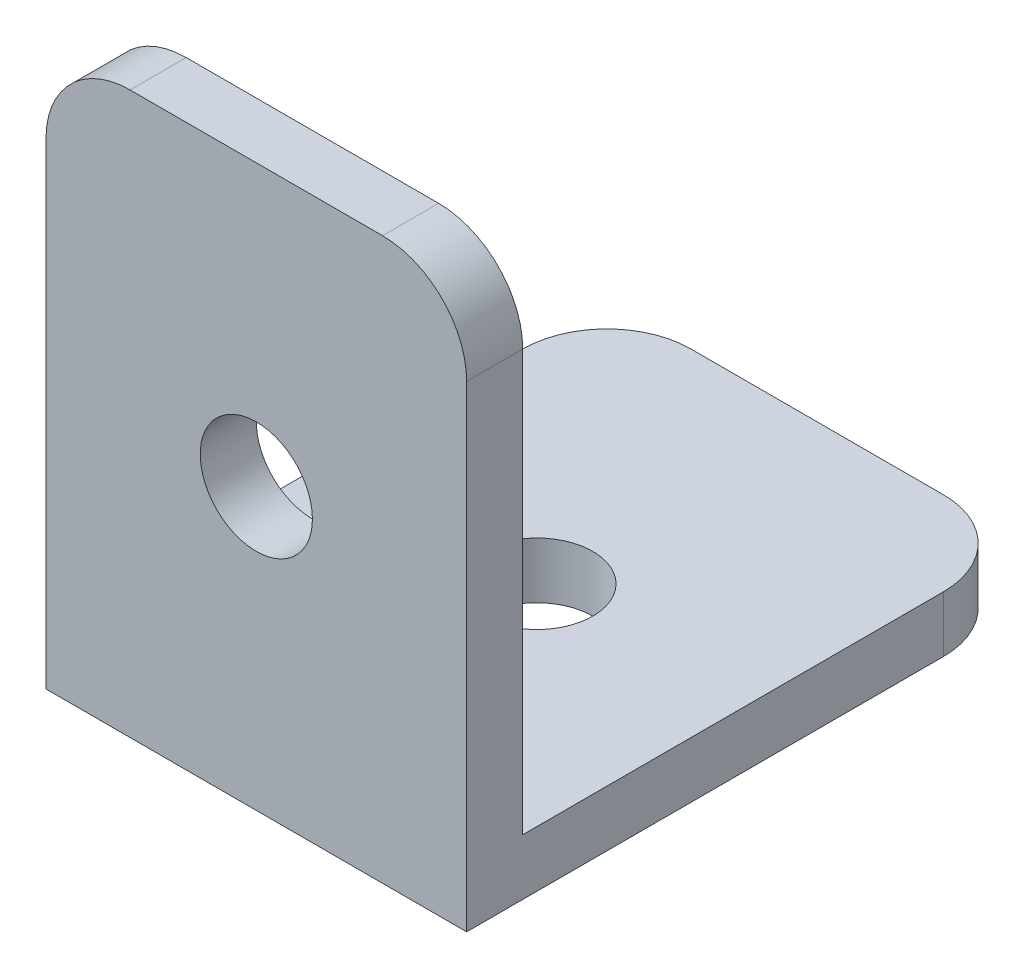
ISO-10303-21;
HEADER;
FILE_DESCRIPTION(('STEP AP214'),'2;1');
FILE_NAME('part.step','',(''),(''),'','','');
FILE_SCHEMA(('AUTOMOTIVE_DESIGN { 1 0 10303 214 1 1 1 1 }'));
ENDSEC;
DATA;
#1=APPLICATION_CONTEXT('core data for automotive mechanical design processes');
#2=APPLICATION_PROTOCOL_DEFINITION('international standard','automotive_design',2000,#1);
#3=PRODUCT_CONTEXT('',#1,'mechanical');
#4=PRODUCT('Part','Part','',(#3));
#5=PRODUCT_RELATED_PRODUCT_CATEGORY('part','',(#4));
#6=PRODUCT_DEFINITION_FORMATION('','',#4);
#7=PRODUCT_DEFINITION_CONTEXT('part definition',#1,'design');
#8=PRODUCT_DEFINITION('design','',#6,#7);
#9=PRODUCT_DEFINITION_SHAPE('','',#8);
#10=(LENGTH_UNIT() NAMED_UNIT(*) SI_UNIT(.MILLI.,.METRE.));
#11=(NAMED_UNIT(*) PLANE_ANGLE_UNIT() SI_UNIT($,.RADIAN.));
#12=(NAMED_UNIT(*) SI_UNIT($,.STERADIAN.) SOLID_ANGLE_UNIT());
#13=UNCERTAINTY_MEASURE_WITH_UNIT(LENGTH_MEASURE(1.E-05),#10,'distance_accuracy_value','');
#14=(GEOMETRIC_REPRESENTATION_CONTEXT(3) GLOBAL_UNCERTAINTY_ASSIGNED_CONTEXT((#13)) GLOBAL_UNIT_ASSIGNED_CONTEXT((#10,
#11,#12)) REPRESENTATION_CONTEXT('',''));
#15=CARTESIAN_POINT('',(0.,0.,0.));
#16=DIRECTION('',(0.,0.,1.));
#17=DIRECTION('',(1.,0.,0.));
#18=AXIS2_PLACEMENT_3D('',#15,#16,#17);
#19=CARTESIAN_POINT('',(3.,2.,-15.));
#20=DIRECTION('',(0.,-1.,0.));
#21=DIRECTION('',(0.,0.,-1.));
#22=AXIS2_PLACEMENT_3D('',#19,#20,#21);
#23=PLANE('',#22);
#24=DIRECTION('',(1.,0.,0.));
#25=VECTOR('',#24,1.);
#26=CARTESIAN_POINT('',(15.,2.,0.));
#27=LINE('',#26,#25);
#28=CARTESIAN_POINT('',(0.,2.,0.));
#29=VERTEX_POINT('',#28);
#30=CARTESIAN_POINT('',(15.,2.,0.));
#31=VERTEX_POINT('',#30);
#32=EDGE_CURVE('E141',#29,#31,#27,.T.);
#33=ORIENTED_EDGE('',*,*,#32,.T.);
#34=DIRECTION('',(0.,0.,-1.));
#35=VECTOR('',#34,1.);
#36=CARTESIAN_POINT('',(15.,2.,-15.));
#37=LINE('',#36,#35);
#38=CARTESIAN_POINT('',(15.,2.,-15.));
#39=VERTEX_POINT('',#38);
#40=EDGE_CURVE('E106',#31,#39,#37,.T.);
#41=ORIENTED_EDGE('',*,*,#40,.T.);
#42=CARTESIAN_POINT('',(12.,2.,-15.));
#43=DIRECTION('',(0.,1.,0.));
#44=DIRECTION('',(0.,0.,-1.));
#45=AXIS2_PLACEMENT_3D('',#42,#43,#44);
#46=CIRCLE('',#45,3.);
#47=CARTESIAN_POINT('',(12.,2.,-18.));
#48=VERTEX_POINT('',#47);
#49=EDGE_CURVE('E100',#39,#48,#46,.T.);
#50=ORIENTED_EDGE('',*,*,#49,.T.);
#51=DIRECTION('',(-1.,0.,0.));
#52=VECTOR('',#51,1.);
#53=CARTESIAN_POINT('',(3.00000000000002,2.,-18.));
#54=LINE('',#53,#52);
#55=CARTESIAN_POINT('',(3.,2.,-18.));
#56=VERTEX_POINT('',#55);
#57=EDGE_CURVE('E105',#48,#56,#54,.T.);
#58=ORIENTED_EDGE('',*,*,#57,.T.);
#59=CARTESIAN_POINT('',(3.,2.,-15.));
#60=DIRECTION('',(0.,1.,0.));
#61=DIRECTION('',(0.,0.,-1.));
#62=AXIS2_PLACEMENT_3D('',#59,#60,#61);
#63=CIRCLE('',#62,3.);
#64=CARTESIAN_POINT('',(0.,2.,-15.));
#65=VERTEX_POINT('',#64);
#66=EDGE_CURVE('E59',#56,#65,#63,.T.);
#67=ORIENTED_EDGE('',*,*,#66,.T.);
#68=DIRECTION('',(0.,0.,1.));
#69=VECTOR('',#68,1.);
#70=CARTESIAN_POINT('',(0.,2.,0.));
#71=LINE('',#70,#69);
#72=EDGE_CURVE('E120',#65,#29,#71,.T.);
#73=ORIENTED_EDGE('',*,*,#72,.T.);
#74=EDGE_LOOP('',(#33,#41,#50,#58,#67,#73));
#75=FACE_BOUND('',#74,.T.);
#76=CARTESIAN_POINT('',(7.5,2.,-8.));
#77=DIRECTION('',(0.,1.,0.));
#78=DIRECTION('',(0.,0.,1.));
#79=AXIS2_PLACEMENT_3D('',#76,#77,#78);
#80=CIRCLE('',#79,2.);
#81=CARTESIAN_POINT('',(7.5,2.,-6.));
#82=VERTEX_POINT('',#81);
#83=EDGE_CURVE('E130',#82,#82,#80,.T.);
#84=ORIENTED_EDGE('',*,*,#83,.F.);
#85=EDGE_LOOP('',(#84));
#86=FACE_BOUND('',#85,.T.);
#87=ADVANCED_FACE('F41',(#75,#86),#23,.F.);
#88=CARTESIAN_POINT('',(3.,0.,-15.));
#89=DIRECTION('',(0.,-1.,0.));
#90=DIRECTION('',(0.,0.,-1.));
#91=AXIS2_PLACEMENT_3D('',#88,#89,#90);
#92=PLANE('',#91);
#93=DIRECTION('',(0.,0.,-1.));
#94=VECTOR('',#93,1.);
#95=CARTESIAN_POINT('',(15.,0.,-15.));
#96=LINE('',#95,#94);
#97=CARTESIAN_POINT('',(15.,0.,2.));
#98=VERTEX_POINT('',#97);
#99=CARTESIAN_POINT('',(15.,0.,-15.));
#100=VERTEX_POINT('',#99);
#101=EDGE_CURVE('E127',#98,#100,#96,.T.);
#102=ORIENTED_EDGE('',*,*,#101,.F.);
#103=DIRECTION('',(1.,0.,0.));
#104=VECTOR('',#103,1.);
#105=CARTESIAN_POINT('',(0.,0.,2.));
#106=LINE('',#105,#104);
#107=CARTESIAN_POINT('',(0.,0.,2.));
#108=VERTEX_POINT('',#107);
#109=EDGE_CURVE('E154',#108,#98,#106,.T.);
#110=ORIENTED_EDGE('',*,*,#109,.F.);
#111=DIRECTION('',(0.,0.,1.));
#112=VECTOR('',#111,1.);
#113=CARTESIAN_POINT('',(0.,0.,0.));
#114=LINE('',#113,#112);
#115=CARTESIAN_POINT('',(0.,0.,-15.));
#116=VERTEX_POINT('',#115);
#117=EDGE_CURVE('E137',#116,#108,#114,.T.);
#118=ORIENTED_EDGE('',*,*,#117,.F.);
#119=CARTESIAN_POINT('',(3.,0.,-15.));
#120=DIRECTION('',(0.,1.,0.));
#121=DIRECTION('',(0.,0.,-1.));
#122=AXIS2_PLACEMENT_3D('',#119,#120,#121);
#123=CIRCLE('',#122,3.);
#124=CARTESIAN_POINT('',(3.,0.,-18.));
#125=VERTEX_POINT('',#124);
#126=EDGE_CURVE('E83',#125,#116,#123,.T.);
#127=ORIENTED_EDGE('',*,*,#126,.F.);
#128=DIRECTION('',(-1.,0.,0.));
#129=VECTOR('',#128,1.);
#130=CARTESIAN_POINT('',(3.00000000000002,0.,-18.));
#131=LINE('',#130,#129);
#132=CARTESIAN_POINT('',(12.,0.,-18.));
#133=VERTEX_POINT('',#132);
#134=EDGE_CURVE('E77',#133,#125,#131,.T.);
#135=ORIENTED_EDGE('',*,*,#134,.F.);
#136=CARTESIAN_POINT('',(12.,0.,-15.));
#137=DIRECTION('',(0.,1.,0.));
#138=DIRECTION('',(0.,0.,-1.));
#139=AXIS2_PLACEMENT_3D('',#136,#137,#138);
#140=CIRCLE('',#139,3.);
#141=EDGE_CURVE('E113',#100,#133,#140,.T.);
#142=ORIENTED_EDGE('',*,*,#141,.F.);
#143=EDGE_LOOP('',(#102,#110,#118,#127,#135,#142));
#144=FACE_BOUND('',#143,.T.);
#145=CARTESIAN_POINT('',(7.5,0.,-8.));
#146=DIRECTION('',(0.,1.,0.));
#147=DIRECTION('',(0.,0.,1.));
#148=AXIS2_PLACEMENT_3D('',#145,#146,#147);
#149=CIRCLE('',#148,2.);
#150=CARTESIAN_POINT('',(7.5,0.,-6.));
#151=VERTEX_POINT('',#150);
#152=EDGE_CURVE('E239',#151,#151,#149,.T.);
#153=ORIENTED_EDGE('',*,*,#152,.T.);
#154=EDGE_LOOP('',(#153));
#155=FACE_BOUND('',#154,.T.);
#156=ADVANCED_FACE('F149',(#144,#155),#92,.T.);
#157=CARTESIAN_POINT('',(15.,2.,-15.));
#158=DIRECTION('',(-1.,0.,0.));
#159=DIRECTION('',(0.,0.,1.));
#160=AXIS2_PLACEMENT_3D('',#157,#158,#159);
#161=PLANE('',#160);
#162=ORIENTED_EDGE('',*,*,#101,.T.);
#163=DIRECTION('',(0.,-1.,0.));
#164=VECTOR('',#163,1.);
#165=CARTESIAN_POINT('',(15.,2.,-15.));
#166=LINE('',#165,#164);
#167=EDGE_CURVE('E11',#39,#100,#166,.T.);
#168=ORIENTED_EDGE('',*,*,#167,.F.);
#169=ORIENTED_EDGE('',*,*,#40,.F.);
#170=DIRECTION('',(0.,1.,0.));
#171=VECTOR('',#170,1.);
#172=CARTESIAN_POINT('',(15.,0.,0.));
#173=LINE('',#172,#171);
#174=CARTESIAN_POINT('',(15.,17.,0.));
#175=VERTEX_POINT('',#174);
#176=EDGE_CURVE('E92',#31,#175,#173,.T.);
#177=ORIENTED_EDGE('',*,*,#176,.T.);
#178=DIRECTION('',(0.,0.,-1.));
#179=VECTOR('',#178,1.);
#180=CARTESIAN_POINT('',(15.,17.,2.));
#181=LINE('',#180,#179);
#182=CARTESIAN_POINT('',(15.,17.,2.));
#183=VERTEX_POINT('',#182);
#184=EDGE_CURVE('E232',#183,#175,#181,.T.);
#185=ORIENTED_EDGE('',*,*,#184,.F.);
#186=DIRECTION('',(0.,1.,0.));
#187=VECTOR('',#186,1.);
#188=CARTESIAN_POINT('',(15.,0.,2.));
#189=LINE('',#188,#187);
#190=EDGE_CURVE('E253',#98,#183,#189,.T.);
#191=ORIENTED_EDGE('',*,*,#190,.F.);
#192=EDGE_LOOP('',(#162,#168,#169,#177,#185,#191));
#193=FACE_BOUND('',#192,.T.);
#194=ADVANCED_FACE('F43',(#193),#161,.F.);
#195=CARTESIAN_POINT('',(12.,2.,-15.));
#196=DIRECTION('',(0.,-1.,0.));
#197=DIRECTION('',(0.,0.,-1.));
#198=AXIS2_PLACEMENT_3D('',#195,#196,#197);
#199=CYLINDRICAL_SURFACE('',#198,3.);
#200=ORIENTED_EDGE('',*,*,#141,.T.);
#201=DIRECTION('',(0.,-1.,0.));
#202=VECTOR('',#201,1.);
#203=CARTESIAN_POINT('',(12.,2.,-18.));
#204=LINE('',#203,#202);
#205=EDGE_CURVE('E51',#48,#133,#204,.T.);
#206=ORIENTED_EDGE('',*,*,#205,.F.);
#207=ORIENTED_EDGE('',*,*,#49,.F.);
#208=ORIENTED_EDGE('',*,*,#167,.T.);
#209=EDGE_LOOP('',(#200,#206,#207,#208));
#210=FACE_BOUND('',#209,.T.);
#211=ADVANCED_FACE('F111',(#210),#199,.T.);
#212=CARTESIAN_POINT('',(3.00000000000002,2.,-18.));
#213=DIRECTION('',(0.,0.,1.));
#214=DIRECTION('',(1.,0.,0.));
#215=AXIS2_PLACEMENT_3D('',#212,#213,#214);
#216=PLANE('',#215);
#217=ORIENTED_EDGE('',*,*,#134,.T.);
#218=DIRECTION('',(0.,-1.,0.));
#219=VECTOR('',#218,1.);
#220=CARTESIAN_POINT('',(3.,2.,-18.));
#221=LINE('',#220,#219);
#222=EDGE_CURVE('E115',#56,#125,#221,.T.);
#223=ORIENTED_EDGE('',*,*,#222,.F.);
#224=ORIENTED_EDGE('',*,*,#57,.F.);
#225=ORIENTED_EDGE('',*,*,#205,.T.);
#226=EDGE_LOOP('',(#217,#223,#224,#225));
#227=FACE_BOUND('',#226,.T.);
#228=ADVANCED_FACE('F116',(#227),#216,.F.);
#229=CARTESIAN_POINT('',(3.,2.,-15.));
#230=DIRECTION('',(0.,-1.,0.));
#231=DIRECTION('',(0.,0.,-1.));
#232=AXIS2_PLACEMENT_3D('',#229,#230,#231);
#233=CYLINDRICAL_SURFACE('',#232,3.);
#234=ORIENTED_EDGE('',*,*,#126,.T.);
#235=DIRECTION('',(0.,-1.,0.));
#236=VECTOR('',#235,1.);
#237=CARTESIAN_POINT('',(0.,2.,-15.));
#238=LINE('',#237,#236);
#239=EDGE_CURVE('E126',#65,#116,#238,.T.);
#240=ORIENTED_EDGE('',*,*,#239,.F.);
#241=ORIENTED_EDGE('',*,*,#66,.F.);
#242=ORIENTED_EDGE('',*,*,#222,.T.);
#243=EDGE_LOOP('',(#234,#240,#241,#242));
#244=FACE_BOUND('',#243,.T.);
#245=ADVANCED_FACE('F145',(#244),#233,.T.);
#246=CARTESIAN_POINT('',(0.,2.,0.));
#247=DIRECTION('',(1.,0.,0.));
#248=DIRECTION('',(0.,0.,-1.));
#249=AXIS2_PLACEMENT_3D('',#246,#247,#248);
#250=PLANE('',#249);
#251=ORIENTED_EDGE('',*,*,#117,.T.);
#252=DIRECTION('',(0.,1.,0.));
#253=VECTOR('',#252,1.);
#254=CARTESIAN_POINT('',(0.,0.,2.));
#255=LINE('',#254,#253);
#256=CARTESIAN_POINT('',(0.,17.,2.));
#257=VERTEX_POINT('',#256);
#258=EDGE_CURVE('E161',#108,#257,#255,.T.);
#259=ORIENTED_EDGE('',*,*,#258,.T.);
#260=DIRECTION('',(0.,0.,-1.));
#261=VECTOR('',#260,1.);
#262=CARTESIAN_POINT('',(0.,17.,2.));
#263=LINE('',#262,#261);
#264=CARTESIAN_POINT('',(0.,17.,0.));
#265=VERTEX_POINT('',#264);
#266=EDGE_CURVE('E236',#257,#265,#263,.T.);
#267=ORIENTED_EDGE('',*,*,#266,.T.);
#268=DIRECTION('',(0.,1.,0.));
#269=VECTOR('',#268,1.);
#270=CARTESIAN_POINT('',(0.,0.,0.));
#271=LINE('',#270,#269);
#272=EDGE_CURVE('E215',#29,#265,#271,.T.);
#273=ORIENTED_EDGE('',*,*,#272,.F.);
#274=ORIENTED_EDGE('',*,*,#72,.F.);
#275=ORIENTED_EDGE('',*,*,#239,.T.);
#276=EDGE_LOOP('',(#251,#259,#267,#273,#274,#275));
#277=FACE_BOUND('',#276,.T.);
#278=ADVANCED_FACE('F158',(#277),#250,.F.);
#279=CARTESIAN_POINT('',(7.5,2.,-8.));
#280=DIRECTION('',(0.,-1.,0.));
#281=DIRECTION('',(0.,0.,-1.));
#282=AXIS2_PLACEMENT_3D('',#279,#280,#281);
#283=CYLINDRICAL_SURFACE('',#282,2.);
#284=ORIENTED_EDGE('',*,*,#83,.T.);
#285=EDGE_LOOP('',(#284));
#286=FACE_BOUND('',#285,.T.);
#287=ORIENTED_EDGE('',*,*,#152,.F.);
#288=EDGE_LOOP('',(#287));
#289=FACE_BOUND('',#288,.T.);
#290=ADVANCED_FACE('F291',(#286,#289),#283,.F.);
#291=CARTESIAN_POINT('',(3.,17.,2.));
#292=DIRECTION('',(0.,0.,-1.));
#293=DIRECTION('',(-1.,0.,0.));
#294=AXIS2_PLACEMENT_3D('',#291,#292,#293);
#295=CYLINDRICAL_SURFACE('',#294,3.);
#296=CARTESIAN_POINT('',(3.,17.,0.));
#297=DIRECTION('',(0.,0.,1.));
#298=DIRECTION('',(1.,0.,0.));
#299=AXIS2_PLACEMENT_3D('',#296,#297,#298);
#300=CIRCLE('',#299,3.);
#301=CARTESIAN_POINT('',(3.,20.,0.));
#302=VERTEX_POINT('',#301);
#303=EDGE_CURVE('E195',#265,#302,#300,.F.);
#304=ORIENTED_EDGE('',*,*,#303,.F.);
#305=ORIENTED_EDGE('',*,*,#266,.F.);
#306=CARTESIAN_POINT('',(3.,17.,2.));
#307=DIRECTION('',(0.,0.,1.));
#308=DIRECTION('',(1.,0.,0.));
#309=AXIS2_PLACEMENT_3D('',#306,#307,#308);
#310=CIRCLE('',#309,3.);
#311=CARTESIAN_POINT('',(3.,20.,2.));
#312=VERTEX_POINT('',#311);
#313=EDGE_CURVE('E197',#257,#312,#310,.F.);
#314=ORIENTED_EDGE('',*,*,#313,.T.);
#315=DIRECTION('',(0.,0.,-1.));
#316=VECTOR('',#315,1.);
#317=CARTESIAN_POINT('',(3.,20.,2.));
#318=LINE('',#317,#316);
#319=EDGE_CURVE('E191',#312,#302,#318,.T.);
#320=ORIENTED_EDGE('',*,*,#319,.T.);
#321=EDGE_LOOP('',(#304,#305,#314,#320));
#322=FACE_BOUND('',#321,.T.);
#323=ADVANCED_FACE('F193',(#322),#295,.T.);
#324=CARTESIAN_POINT('',(12.,17.,2.));
#325=DIRECTION('',(0.,0.,-1.));
#326=DIRECTION('',(-1.,0.,0.));
#327=AXIS2_PLACEMENT_3D('',#324,#325,#326);
#328=CYLINDRICAL_SURFACE('',#327,3.);
#329=CARTESIAN_POINT('',(12.,17.,0.));
#330=DIRECTION('',(0.,0.,1.));
#331=DIRECTION('',(1.,0.,0.));
#332=AXIS2_PLACEMENT_3D('',#329,#330,#331);
#333=CIRCLE('',#332,3.);
#334=CARTESIAN_POINT('',(12.,20.,0.));
#335=VERTEX_POINT('',#334);
#336=EDGE_CURVE('E210',#175,#335,#333,.T.);
#337=ORIENTED_EDGE('',*,*,#336,.T.);
#338=DIRECTION('',(0.,0.,-1.));
#339=VECTOR('',#338,1.);
#340=CARTESIAN_POINT('',(12.,20.,2.));
#341=LINE('',#340,#339);
#342=CARTESIAN_POINT('',(12.,20.,2.));
#343=VERTEX_POINT('',#342);
#344=EDGE_CURVE('E200',#343,#335,#341,.T.);
#345=ORIENTED_EDGE('',*,*,#344,.F.);
#346=CARTESIAN_POINT('',(12.,17.,2.));
#347=DIRECTION('',(0.,0.,1.));
#348=DIRECTION('',(1.,0.,0.));
#349=AXIS2_PLACEMENT_3D('',#346,#347,#348);
#350=CIRCLE('',#349,3.);
#351=EDGE_CURVE('E250',#183,#343,#350,.T.);
#352=ORIENTED_EDGE('',*,*,#351,.F.);
#353=ORIENTED_EDGE('',*,*,#184,.T.);
#354=EDGE_LOOP('',(#337,#345,#352,#353));
#355=FACE_BOUND('',#354,.T.);
#356=ADVANCED_FACE('F278',(#355),#328,.T.);
#357=CARTESIAN_POINT('',(7.5,10.,2.));
#358=DIRECTION('',(0.,0.,-1.));
#359=DIRECTION('',(-1.,0.,0.));
#360=AXIS2_PLACEMENT_3D('',#357,#358,#359);
#361=CYLINDRICAL_SURFACE('',#360,2.);
#362=CARTESIAN_POINT('',(7.5,10.,2.));
#363=DIRECTION('',(0.,0.,1.));
#364=DIRECTION('',(1.,0.,0.));
#365=AXIS2_PLACEMENT_3D('',#362,#363,#364);
#366=CIRCLE('',#365,2.);
#367=CARTESIAN_POINT('',(9.5,10.,2.));
#368=VERTEX_POINT('',#367);
#369=EDGE_CURVE('E209',#368,#368,#366,.T.);
#370=ORIENTED_EDGE('',*,*,#369,.T.);
#371=EDGE_LOOP('',(#370));
#372=FACE_BOUND('',#371,.T.);
#373=CARTESIAN_POINT('',(7.5,10.,0.));
#374=DIRECTION('',(0.,0.,1.));
#375=DIRECTION('',(1.,0.,0.));
#376=AXIS2_PLACEMENT_3D('',#373,#374,#375);
#377=CIRCLE('',#376,2.);
#378=CARTESIAN_POINT('',(9.5,10.,0.));
#379=VERTEX_POINT('',#378);
#380=EDGE_CURVE('E217',#379,#379,#377,.T.);
#381=ORIENTED_EDGE('',*,*,#380,.F.);
#382=EDGE_LOOP('',(#381));
#383=FACE_BOUND('',#382,.T.);
#384=ADVANCED_FACE('F268',(#372,#383),#361,.F.);
#385=CARTESIAN_POINT('',(0.,20.,2.));
#386=DIRECTION('',(0.,-1.,0.));
#387=DIRECTION('',(1.,0.,0.));
#388=AXIS2_PLACEMENT_3D('',#385,#386,#387);
#389=PLANE('',#388);
#390=DIRECTION('',(-1.,0.,0.));
#391=VECTOR('',#390,1.);
#392=CARTESIAN_POINT('',(0.,20.,0.));
#393=LINE('',#392,#391);
#394=EDGE_CURVE('E204',#335,#302,#393,.T.);
#395=ORIENTED_EDGE('',*,*,#394,.T.);
#396=ORIENTED_EDGE('',*,*,#319,.F.);
#397=DIRECTION('',(-1.,0.,0.));
#398=VECTOR('',#397,1.);
#399=CARTESIAN_POINT('',(0.,20.,2.));
#400=LINE('',#399,#398);
#401=EDGE_CURVE('E201',#343,#312,#400,.T.);
#402=ORIENTED_EDGE('',*,*,#401,.F.);
#403=ORIENTED_EDGE('',*,*,#344,.T.);
#404=EDGE_LOOP('',(#395,#396,#402,#403));
#405=FACE_BOUND('',#404,.T.);
#406=ADVANCED_FACE('F205',(#405),#389,.F.);
#407=CARTESIAN_POINT('',(0.,0.,2.));
#408=DIRECTION('',(0.,0.,1.));
#409=DIRECTION('',(1.,0.,0.));
#410=AXIS2_PLACEMENT_3D('',#407,#408,#409);
#411=PLANE('',#410);
#412=ORIENTED_EDGE('',*,*,#369,.F.);
#413=EDGE_LOOP('',(#412));
#414=FACE_BOUND('',#413,.T.);
#415=ORIENTED_EDGE('',*,*,#313,.F.);
#416=ORIENTED_EDGE('',*,*,#258,.F.);
#417=ORIENTED_EDGE('',*,*,#109,.T.);
#418=ORIENTED_EDGE('',*,*,#190,.T.);
#419=ORIENTED_EDGE('',*,*,#351,.T.);
#420=ORIENTED_EDGE('',*,*,#401,.T.);
#421=EDGE_LOOP('',(#415,#416,#417,#418,#419,#420));
#422=FACE_BOUND('',#421,.T.);
#423=ADVANCED_FACE('F271',(#414,#422),#411,.T.);
#424=CARTESIAN_POINT('',(0.,0.,0.));
#425=DIRECTION('',(0.,0.,1.));
#426=DIRECTION('',(1.,0.,0.));
#427=AXIS2_PLACEMENT_3D('',#424,#425,#426);
#428=PLANE('',#427);
#429=ORIENTED_EDGE('',*,*,#32,.F.);
#430=ORIENTED_EDGE('',*,*,#272,.T.);
#431=ORIENTED_EDGE('',*,*,#303,.T.);
#432=ORIENTED_EDGE('',*,*,#394,.F.);
#433=ORIENTED_EDGE('',*,*,#336,.F.);
#434=ORIENTED_EDGE('',*,*,#176,.F.);
#435=EDGE_LOOP('',(#429,#430,#431,#432,#433,#434));
#436=FACE_BOUND('',#435,.T.);
#437=ORIENTED_EDGE('',*,*,#380,.T.);
#438=EDGE_LOOP('',(#437));
#439=FACE_BOUND('',#438,.T.);
#440=ADVANCED_FACE('F212',(#436,#439),#428,.F.);
#441=CLOSED_SHELL('',(#87,#156,#194,#211,#228,#245,#278,#290,#323,#356,#384,#406,#423,#440));
#442=MANIFOLD_SOLID_BREP('B2',#441);
#443=ADVANCED_BREP_SHAPE_REPRESENTATION('',(#18,#442),#14);
#444=SHAPE_DEFINITION_REPRESENTATION(#9,#443);
ENDSEC;
END-ISO-10303-21;
